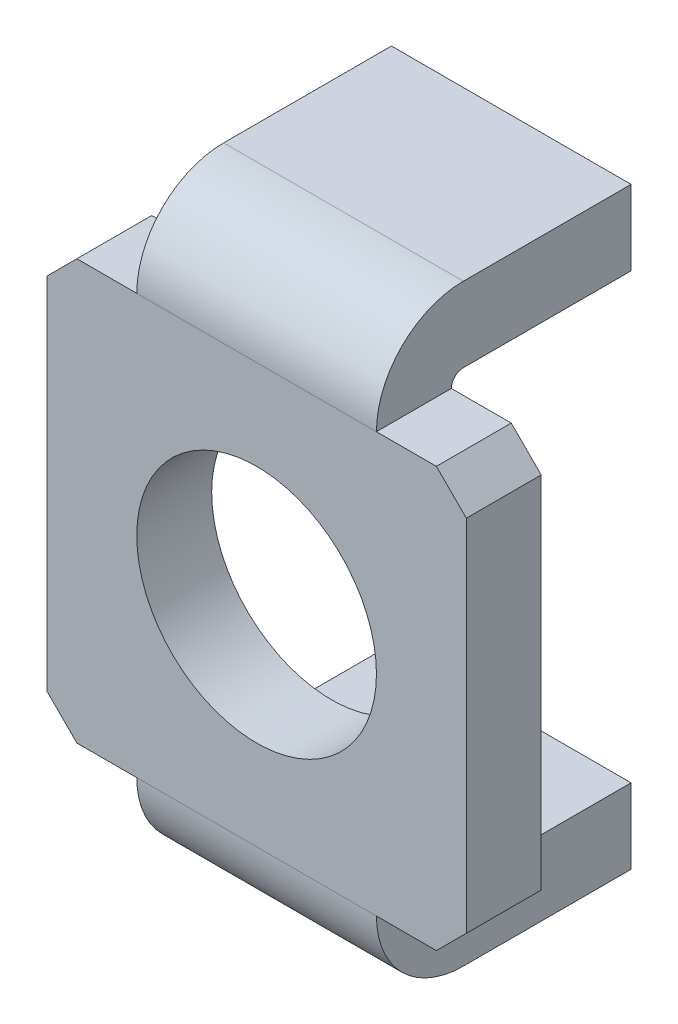
ISO-10303-21;
HEADER;
FILE_DESCRIPTION(('STEP AP214'),'2;1');
FILE_NAME('part.step','',(''),(''),'','','');
FILE_SCHEMA(('AUTOMOTIVE_DESIGN { 1 0 10303 214 1 1 1 1 }'));
ENDSEC;
DATA;
#1=APPLICATION_CONTEXT('core data for automotive mechanical design processes');
#2=APPLICATION_PROTOCOL_DEFINITION('international standard','automotive_design',2000,#1);
#3=PRODUCT_CONTEXT('',#1,'mechanical');
#4=PRODUCT('Part','Part','',(#3));
#5=PRODUCT_RELATED_PRODUCT_CATEGORY('part','',(#4));
#6=PRODUCT_DEFINITION_FORMATION('','',#4);
#7=PRODUCT_DEFINITION_CONTEXT('part definition',#1,'design');
#8=PRODUCT_DEFINITION('design','',#6,#7);
#9=PRODUCT_DEFINITION_SHAPE('','',#8);
#10=(LENGTH_UNIT() NAMED_UNIT(*) SI_UNIT(.MILLI.,.METRE.));
#11=(NAMED_UNIT(*) PLANE_ANGLE_UNIT() SI_UNIT($,.RADIAN.));
#12=(NAMED_UNIT(*) SI_UNIT($,.STERADIAN.) SOLID_ANGLE_UNIT());
#13=UNCERTAINTY_MEASURE_WITH_UNIT(LENGTH_MEASURE(1.E-05),#10,'distance_accuracy_value','');
#14=(GEOMETRIC_REPRESENTATION_CONTEXT(3) GLOBAL_UNCERTAINTY_ASSIGNED_CONTEXT((#13)) GLOBAL_UNIT_ASSIGNED_CONTEXT((#10,
#11,#12)) REPRESENTATION_CONTEXT('',''));
#15=CARTESIAN_POINT('',(0.,0.,0.));
#16=DIRECTION('',(0.,0.,1.));
#17=DIRECTION('',(1.,0.,0.));
#18=AXIS2_PLACEMENT_3D('',#15,#16,#17);
#19=CARTESIAN_POINT('',(0.,-4.95,0.));
#20=DIRECTION('',(0.,1.,0.));
#21=DIRECTION('',(0.,0.,1.));
#22=AXIS2_PLACEMENT_3D('',#19,#20,#21);
#23=PLANE('',#22);
#24=DIRECTION('',(0.,0.,1.));
#25=VECTOR('',#24,1.);
#26=CARTESIAN_POINT('',(-2.,-4.95000000000001,-4.25));
#27=LINE('',#26,#25);
#28=CARTESIAN_POINT('',(-2.,-4.95000000000001,-4.25));
#29=VERTEX_POINT('',#28);
#30=CARTESIAN_POINT('',(-2.,-4.95000000000001,-1.45));
#31=VERTEX_POINT('',#30);
#32=EDGE_CURVE('E197',#29,#31,#27,.T.);
#33=ORIENTED_EDGE('',*,*,#32,.F.);
#34=DIRECTION('',(1.,0.,0.));
#35=VECTOR('',#34,1.);
#36=CARTESIAN_POINT('',(-2.,-4.95000000000001,-4.25));
#37=LINE('',#36,#35);
#38=CARTESIAN_POINT('',(2.,-4.95,-4.25));
#39=VERTEX_POINT('',#38);
#40=EDGE_CURVE('E209',#39,#29,#37,.F.);
#41=ORIENTED_EDGE('',*,*,#40,.F.);
#42=DIRECTION('',(0.,0.,-1.));
#43=VECTOR('',#42,1.);
#44=CARTESIAN_POINT('',(2.,-4.95,-4.25));
#45=LINE('',#44,#43);
#46=CARTESIAN_POINT('',(2.,-4.95,-1.45));
#47=VERTEX_POINT('',#46);
#48=EDGE_CURVE('E201',#47,#39,#45,.T.);
#49=ORIENTED_EDGE('',*,*,#48,.F.);
#50=DIRECTION('',(-1.,0.,0.));
#51=VECTOR('',#50,1.);
#52=CARTESIAN_POINT('',(-2.,-4.95,-1.44999999999999));
#53=LINE('',#52,#51);
#54=EDGE_CURVE('E276',#31,#47,#53,.F.);
#55=ORIENTED_EDGE('',*,*,#54,.F.);
#56=EDGE_LOOP('',(#33,#41,#49,#55));
#57=FACE_BOUND('',#56,.T.);
#58=ADVANCED_FACE('F16',(#57),#23,.F.);
#59=CARTESIAN_POINT('',(0.,4.95,0.));
#60=DIRECTION('',(0.,-1.,0.));
#61=DIRECTION('',(0.,0.,-1.));
#62=AXIS2_PLACEMENT_3D('',#59,#60,#61);
#63=PLANE('',#62);
#64=DIRECTION('',(0.,0.,1.));
#65=VECTOR('',#64,1.);
#66=CARTESIAN_POINT('',(2.,4.95,-4.25));
#67=LINE('',#66,#65);
#68=CARTESIAN_POINT('',(2.,4.95,-1.45));
#69=VERTEX_POINT('',#68);
#70=CARTESIAN_POINT('',(2.,4.95000000000001,-4.25));
#71=VERTEX_POINT('',#70);
#72=EDGE_CURVE('E266',#69,#71,#67,.F.);
#73=ORIENTED_EDGE('',*,*,#72,.T.);
#74=DIRECTION('',(1.,0.,0.));
#75=VECTOR('',#74,1.);
#76=CARTESIAN_POINT('',(-2.,4.95000000000001,-4.25));
#77=LINE('',#76,#75);
#78=CARTESIAN_POINT('',(-2.,4.95000000000001,-4.25));
#79=VERTEX_POINT('',#78);
#80=EDGE_CURVE('E380',#71,#79,#77,.F.);
#81=ORIENTED_EDGE('',*,*,#80,.T.);
#82=DIRECTION('',(0.,0.,-1.));
#83=VECTOR('',#82,1.);
#84=CARTESIAN_POINT('',(-2.,4.95000000000001,-4.25));
#85=LINE('',#84,#83);
#86=CARTESIAN_POINT('',(-2.,4.95000000000001,-1.45));
#87=VERTEX_POINT('',#86);
#88=EDGE_CURVE('E387',#79,#87,#85,.F.);
#89=ORIENTED_EDGE('',*,*,#88,.T.);
#90=DIRECTION('',(1.,0.,0.));
#91=VECTOR('',#90,1.);
#92=CARTESIAN_POINT('',(2.,4.95,-1.45));
#93=LINE('',#92,#91);
#94=EDGE_CURVE('E267',#69,#87,#93,.F.);
#95=ORIENTED_EDGE('',*,*,#94,.F.);
#96=EDGE_LOOP('',(#73,#81,#89,#95));
#97=FACE_BOUND('',#96,.T.);
#98=ADVANCED_FACE('F406',(#97),#63,.F.);
#99=CARTESIAN_POINT('',(-2.,-4.95000000000001,-4.25));
#100=DIRECTION('',(-1.,0.,0.));
#101=DIRECTION('',(0.,0.,1.));
#102=AXIS2_PLACEMENT_3D('',#99,#100,#101);
#103=PLANE('',#102);
#104=DIRECTION('',(0.,0.,1.));
#105=VECTOR('',#104,1.);
#106=CARTESIAN_POINT('',(-2.,-3.7,0.));
#107=LINE('',#106,#105);
#108=CARTESIAN_POINT('',(-2.,-3.70000000000001,-4.25));
#109=VERTEX_POINT('',#108);
#110=CARTESIAN_POINT('',(-2.,-3.7,-1.45));
#111=VERTEX_POINT('',#110);
#112=EDGE_CURVE('E154',#109,#111,#107,.T.);
#113=ORIENTED_EDGE('',*,*,#112,.F.);
#114=DIRECTION('',(0.,1.,0.));
#115=VECTOR('',#114,1.);
#116=CARTESIAN_POINT('',(-2.,-4.95000000000001,-4.25));
#117=LINE('',#116,#115);
#118=EDGE_CURVE('E205',#29,#109,#117,.T.);
#119=ORIENTED_EDGE('',*,*,#118,.F.);
#120=ORIENTED_EDGE('',*,*,#32,.T.);
#121=CARTESIAN_POINT('',(-2.,-3.5,-1.45));
#122=DIRECTION('',(-1.,0.,0.));
#123=DIRECTION('',(0.,0.,1.));
#124=AXIS2_PLACEMENT_3D('',#121,#122,#123);
#125=CIRCLE('',#124,1.45);
#126=CARTESIAN_POINT('',(-2.,-3.5,0.));
#127=VERTEX_POINT('',#126);
#128=EDGE_CURVE('E208',#127,#31,#125,.F.);
#129=ORIENTED_EDGE('',*,*,#128,.F.);
#130=DIRECTION('',(0.,0.,-1.));
#131=VECTOR('',#130,1.);
#132=CARTESIAN_POINT('',(-2.,-3.5,-1.45));
#133=LINE('',#132,#131);
#134=CARTESIAN_POINT('',(-2.,-3.5,-1.25));
#135=VERTEX_POINT('',#134);
#136=EDGE_CURVE('E157',#135,#127,#133,.F.);
#137=ORIENTED_EDGE('',*,*,#136,.F.);
#138=CARTESIAN_POINT('',(-2.,-3.5,-1.45));
#139=DIRECTION('',(-1.,0.,0.));
#140=DIRECTION('',(0.,0.,1.));
#141=AXIS2_PLACEMENT_3D('',#138,#139,#140);
#142=CIRCLE('',#141,0.2);
#143=EDGE_CURVE('E19',#111,#135,#142,.T.);
#144=ORIENTED_EDGE('',*,*,#143,.F.);
#145=EDGE_LOOP('',(#113,#119,#120,#129,#137,#144));
#146=FACE_BOUND('',#145,.T.);
#147=ADVANCED_FACE('F152',(#146),#103,.T.);
#148=CARTESIAN_POINT('',(2.,-4.95000000000001,-4.25));
#149=DIRECTION('',(1.,0.,0.));
#150=DIRECTION('',(0.,0.,-1.));
#151=AXIS2_PLACEMENT_3D('',#148,#149,#150);
#152=PLANE('',#151);
#153=ORIENTED_EDGE('',*,*,#48,.T.);
#154=DIRECTION('',(0.,1.,0.));
#155=VECTOR('',#154,1.);
#156=CARTESIAN_POINT('',(2.,-4.95000000000001,-4.25));
#157=LINE('',#156,#155);
#158=CARTESIAN_POINT('',(2.,-3.70000000000001,-4.25));
#159=VERTEX_POINT('',#158);
#160=EDGE_CURVE('E310',#159,#39,#157,.F.);
#161=ORIENTED_EDGE('',*,*,#160,.F.);
#162=DIRECTION('',(0.,0.,1.));
#163=VECTOR('',#162,1.);
#164=CARTESIAN_POINT('',(2.,-3.7,0.));
#165=LINE('',#164,#163);
#166=CARTESIAN_POINT('',(2.,-3.7,-1.45));
#167=VERTEX_POINT('',#166);
#168=EDGE_CURVE('E173',#167,#159,#165,.F.);
#169=ORIENTED_EDGE('',*,*,#168,.F.);
#170=CARTESIAN_POINT('',(2.,-3.5,-1.45));
#171=DIRECTION('',(-1.,0.,0.));
#172=DIRECTION('',(0.,0.,1.));
#173=AXIS2_PLACEMENT_3D('',#170,#171,#172);
#174=CIRCLE('',#173,0.2);
#175=CARTESIAN_POINT('',(2.,-3.5,-1.25));
#176=VERTEX_POINT('',#175);
#177=EDGE_CURVE('E163',#167,#176,#174,.T.);
#178=ORIENTED_EDGE('',*,*,#177,.T.);
#179=DIRECTION('',(0.,0.,-1.));
#180=VECTOR('',#179,1.);
#181=CARTESIAN_POINT('',(2.,-3.5,-1.45));
#182=LINE('',#181,#180);
#183=CARTESIAN_POINT('',(2.,-3.5,0.));
#184=VERTEX_POINT('',#183);
#185=EDGE_CURVE('E287',#176,#184,#182,.F.);
#186=ORIENTED_EDGE('',*,*,#185,.T.);
#187=CARTESIAN_POINT('',(2.,-3.5,-1.45));
#188=DIRECTION('',(-1.,0.,0.));
#189=DIRECTION('',(0.,0.,1.));
#190=AXIS2_PLACEMENT_3D('',#187,#188,#189);
#191=CIRCLE('',#190,1.45);
#192=EDGE_CURVE('E272',#47,#184,#191,.T.);
#193=ORIENTED_EDGE('',*,*,#192,.F.);
#194=EDGE_LOOP('',(#153,#161,#169,#178,#186,#193));
#195=FACE_BOUND('',#194,.T.);
#196=ADVANCED_FACE('F326',(#195),#152,.T.);
#197=CARTESIAN_POINT('',(-2.,-4.95000000000001,-4.25));
#198=DIRECTION('',(0.,0.,-1.));
#199=DIRECTION('',(0.,1.,0.));
#200=AXIS2_PLACEMENT_3D('',#197,#198,#199);
#201=PLANE('',#200);
#202=ORIENTED_EDGE('',*,*,#40,.T.);
#203=ORIENTED_EDGE('',*,*,#118,.T.);
#204=DIRECTION('',(1.,0.,0.));
#205=VECTOR('',#204,1.);
#206=CARTESIAN_POINT('',(0.,-3.70000000000001,-4.25));
#207=LINE('',#206,#205);
#208=EDGE_CURVE('E171',#159,#109,#207,.F.);
#209=ORIENTED_EDGE('',*,*,#208,.F.);
#210=ORIENTED_EDGE('',*,*,#160,.T.);
#211=EDGE_LOOP('',(#202,#203,#209,#210));
#212=FACE_BOUND('',#211,.T.);
#213=ADVANCED_FACE('F324',(#212),#201,.T.);
#214=CARTESIAN_POINT('',(-2.,-3.5,-1.45));
#215=DIRECTION('',(-1.,0.,0.));
#216=DIRECTION('',(0.,0.,1.));
#217=AXIS2_PLACEMENT_3D('',#214,#215,#216);
#218=CYLINDRICAL_SURFACE('',#217,1.45);
#219=ORIENTED_EDGE('',*,*,#54,.T.);
#220=ORIENTED_EDGE('',*,*,#192,.T.);
#221=DIRECTION('',(-1.,0.,0.));
#222=VECTOR('',#221,1.);
#223=CARTESIAN_POINT('',(0.,-3.50000000000001,0.));
#224=LINE('',#223,#222);
#225=EDGE_CURVE('E302',#184,#127,#224,.T.);
#226=ORIENTED_EDGE('',*,*,#225,.T.);
#227=ORIENTED_EDGE('',*,*,#128,.T.);
#228=EDGE_LOOP('',(#219,#220,#226,#227));
#229=FACE_BOUND('',#228,.T.);
#230=ADVANCED_FACE('F332',(#229),#218,.T.);
#231=CARTESIAN_POINT('',(2.,3.5,-1.45));
#232=DIRECTION('',(1.,0.,0.));
#233=DIRECTION('',(0.,0.,-1.));
#234=AXIS2_PLACEMENT_3D('',#231,#232,#233);
#235=CYLINDRICAL_SURFACE('',#234,1.45);
#236=ORIENTED_EDGE('',*,*,#94,.T.);
#237=CARTESIAN_POINT('',(-2.,3.5,-1.45));
#238=DIRECTION('',(1.,0.,0.));
#239=DIRECTION('',(0.,0.,-1.));
#240=AXIS2_PLACEMENT_3D('',#237,#238,#239);
#241=CIRCLE('',#240,1.45);
#242=CARTESIAN_POINT('',(-2.,3.5,0.));
#243=VERTEX_POINT('',#242);
#244=EDGE_CURVE('E263',#87,#243,#241,.T.);
#245=ORIENTED_EDGE('',*,*,#244,.T.);
#246=DIRECTION('',(-1.,0.,0.));
#247=VECTOR('',#246,1.);
#248=CARTESIAN_POINT('',(0.,3.5,0.));
#249=LINE('',#248,#247);
#250=CARTESIAN_POINT('',(2.,3.5,0.));
#251=VERTEX_POINT('',#250);
#252=EDGE_CURVE('E395',#243,#251,#249,.F.);
#253=ORIENTED_EDGE('',*,*,#252,.T.);
#254=CARTESIAN_POINT('',(2.,3.5,-1.45));
#255=DIRECTION('',(1.,0.,0.));
#256=DIRECTION('',(0.,0.,-1.));
#257=AXIS2_PLACEMENT_3D('',#254,#255,#256);
#258=CIRCLE('',#257,1.45);
#259=EDGE_CURVE('E268',#251,#69,#258,.F.);
#260=ORIENTED_EDGE('',*,*,#259,.T.);
#261=EDGE_LOOP('',(#236,#245,#253,#260));
#262=FACE_BOUND('',#261,.T.);
#263=ADVANCED_FACE('F424',(#262),#235,.T.);
#264=CARTESIAN_POINT('',(2.,4.95000000000001,-4.25));
#265=DIRECTION('',(-1.,0.,0.));
#266=DIRECTION('',(0.,0.,1.));
#267=AXIS2_PLACEMENT_3D('',#264,#265,#266);
#268=PLANE('',#267);
#269=DIRECTION('',(0.,0.,-1.));
#270=VECTOR('',#269,1.);
#271=CARTESIAN_POINT('',(2.,3.7,0.));
#272=LINE('',#271,#270);
#273=CARTESIAN_POINT('',(2.,3.70000000000001,-4.25));
#274=VERTEX_POINT('',#273);
#275=CARTESIAN_POINT('',(2.,3.7,-1.45));
#276=VERTEX_POINT('',#275);
#277=EDGE_CURVE('E226',#274,#276,#272,.F.);
#278=ORIENTED_EDGE('',*,*,#277,.F.);
#279=DIRECTION('',(0.,-1.,0.));
#280=VECTOR('',#279,1.);
#281=CARTESIAN_POINT('',(2.,4.95000000000001,-4.25));
#282=LINE('',#281,#280);
#283=EDGE_CURVE('E383',#274,#71,#282,.F.);
#284=ORIENTED_EDGE('',*,*,#283,.T.);
#285=ORIENTED_EDGE('',*,*,#72,.F.);
#286=ORIENTED_EDGE('',*,*,#259,.F.);
#287=DIRECTION('',(0.,0.,1.));
#288=VECTOR('',#287,1.);
#289=CARTESIAN_POINT('',(2.,3.5,-1.45));
#290=LINE('',#289,#288);
#291=CARTESIAN_POINT('',(2.,3.5,-1.25));
#292=VERTEX_POINT('',#291);
#293=EDGE_CURVE('E285',#292,#251,#290,.T.);
#294=ORIENTED_EDGE('',*,*,#293,.F.);
#295=CARTESIAN_POINT('',(2.,3.5,-1.45));
#296=DIRECTION('',(1.,0.,0.));
#297=DIRECTION('',(0.,0.,-1.));
#298=AXIS2_PLACEMENT_3D('',#295,#296,#297);
#299=CIRCLE('',#298,0.2);
#300=EDGE_CURVE('E283',#276,#292,#299,.T.);
#301=ORIENTED_EDGE('',*,*,#300,.F.);
#302=EDGE_LOOP('',(#278,#284,#285,#286,#294,#301));
#303=FACE_BOUND('',#302,.T.);
#304=ADVANCED_FACE('F412',(#303),#268,.F.);
#305=CARTESIAN_POINT('',(-2.,4.95000000000001,-4.25));
#306=DIRECTION('',(1.,0.,0.));
#307=DIRECTION('',(0.,0.,-1.));
#308=AXIS2_PLACEMENT_3D('',#305,#306,#307);
#309=PLANE('',#308);
#310=ORIENTED_EDGE('',*,*,#88,.F.);
#311=DIRECTION('',(0.,-1.,0.));
#312=VECTOR('',#311,1.);
#313=CARTESIAN_POINT('',(-2.,4.95000000000001,-4.25));
#314=LINE('',#313,#312);
#315=CARTESIAN_POINT('',(-2.,3.70000000000001,-4.25));
#316=VERTEX_POINT('',#315);
#317=EDGE_CURVE('E174',#79,#316,#314,.T.);
#318=ORIENTED_EDGE('',*,*,#317,.T.);
#319=DIRECTION('',(0.,0.,-1.));
#320=VECTOR('',#319,1.);
#321=CARTESIAN_POINT('',(-2.,3.7,0.));
#322=LINE('',#321,#320);
#323=CARTESIAN_POINT('',(-2.,3.7,-1.45));
#324=VERTEX_POINT('',#323);
#325=EDGE_CURVE('E221',#324,#316,#322,.T.);
#326=ORIENTED_EDGE('',*,*,#325,.F.);
#327=CARTESIAN_POINT('',(-2.,3.5,-1.45));
#328=DIRECTION('',(1.,0.,0.));
#329=DIRECTION('',(0.,0.,-1.));
#330=AXIS2_PLACEMENT_3D('',#327,#328,#329);
#331=CIRCLE('',#330,0.2);
#332=CARTESIAN_POINT('',(-2.,3.5,-1.25));
#333=VERTEX_POINT('',#332);
#334=EDGE_CURVE('E279',#324,#333,#331,.T.);
#335=ORIENTED_EDGE('',*,*,#334,.T.);
#336=DIRECTION('',(0.,0.,1.));
#337=VECTOR('',#336,1.);
#338=CARTESIAN_POINT('',(-2.,3.5,-1.45));
#339=LINE('',#338,#337);
#340=EDGE_CURVE('E202',#333,#243,#339,.T.);
#341=ORIENTED_EDGE('',*,*,#340,.T.);
#342=ORIENTED_EDGE('',*,*,#244,.F.);
#343=EDGE_LOOP('',(#310,#318,#326,#335,#341,#342));
#344=FACE_BOUND('',#343,.T.);
#345=ADVANCED_FACE('F420',(#344),#309,.F.);
#346=CARTESIAN_POINT('',(-2.,4.95000000000001,-4.25));
#347=DIRECTION('',(0.,0.,1.));
#348=DIRECTION('',(0.,-1.,0.));
#349=AXIS2_PLACEMENT_3D('',#346,#347,#348);
#350=PLANE('',#349);
#351=ORIENTED_EDGE('',*,*,#317,.F.);
#352=ORIENTED_EDGE('',*,*,#80,.F.);
#353=ORIENTED_EDGE('',*,*,#283,.F.);
#354=DIRECTION('',(1.,0.,0.));
#355=VECTOR('',#354,1.);
#356=CARTESIAN_POINT('',(0.,3.70000000000001,-4.25));
#357=LINE('',#356,#355);
#358=EDGE_CURVE('E225',#316,#274,#357,.T.);
#359=ORIENTED_EDGE('',*,*,#358,.F.);
#360=EDGE_LOOP('',(#351,#352,#353,#359));
#361=FACE_BOUND('',#360,.T.);
#362=ADVANCED_FACE('F417',(#361),#350,.F.);
#363=CARTESIAN_POINT('',(0.,-3.7,0.));
#364=DIRECTION('',(0.,1.,0.));
#365=DIRECTION('',(0.,0.,1.));
#366=AXIS2_PLACEMENT_3D('',#363,#364,#365);
#367=PLANE('',#366);
#368=ORIENTED_EDGE('',*,*,#168,.T.);
#369=ORIENTED_EDGE('',*,*,#208,.T.);
#370=ORIENTED_EDGE('',*,*,#112,.T.);
#371=DIRECTION('',(-1.,0.,0.));
#372=VECTOR('',#371,1.);
#373=CARTESIAN_POINT('',(-2.,-3.7,-1.45));
#374=LINE('',#373,#372);
#375=EDGE_CURVE('E169',#111,#167,#374,.F.);
#376=ORIENTED_EDGE('',*,*,#375,.T.);
#377=EDGE_LOOP('',(#368,#369,#370,#376));
#378=FACE_BOUND('',#377,.T.);
#379=ADVANCED_FACE('F168',(#378),#367,.T.);
#380=CARTESIAN_POINT('',(0.,0.,0.));
#381=DIRECTION('',(0.,0.,-1.));
#382=DIRECTION('',(-1.,0.,0.));
#383=AXIS2_PLACEMENT_3D('',#380,#381,#382);
#384=PLANE('',#383);
#385=DIRECTION('',(-0.707106781186547,-0.707106781186548,0.));
#386=VECTOR('',#385,1.);
#387=CARTESIAN_POINT('',(3.,-3.5,0.));
#388=LINE('',#387,#386);
#389=CARTESIAN_POINT('',(3.,-3.5,0.));
#390=VERTEX_POINT('',#389);
#391=CARTESIAN_POINT('',(3.5,-2.99999999999999,0.));
#392=VERTEX_POINT('',#391);
#393=EDGE_CURVE('E362',#390,#392,#388,.F.);
#394=ORIENTED_EDGE('',*,*,#393,.T.);
#395=DIRECTION('',(0.,1.,0.));
#396=VECTOR('',#395,1.);
#397=CARTESIAN_POINT('',(3.5,3.5,0.));
#398=LINE('',#397,#396);
#399=CARTESIAN_POINT('',(3.5,3.,0.));
#400=VERTEX_POINT('',#399);
#401=EDGE_CURVE('E262',#400,#392,#398,.F.);
#402=ORIENTED_EDGE('',*,*,#401,.F.);
#403=DIRECTION('',(0.707106781186549,-0.707106781186546,0.));
#404=VECTOR('',#403,1.);
#405=CARTESIAN_POINT('',(3.,3.5,0.));
#406=LINE('',#405,#404);
#407=CARTESIAN_POINT('',(2.99999999999999,3.5,0.));
#408=VERTEX_POINT('',#407);
#409=EDGE_CURVE('E239',#408,#400,#406,.T.);
#410=ORIENTED_EDGE('',*,*,#409,.F.);
#411=DIRECTION('',(-1.,0.,0.));
#412=VECTOR('',#411,1.);
#413=CARTESIAN_POINT('',(0.,3.5,0.));
#414=LINE('',#413,#412);
#415=EDGE_CURVE('E298',#251,#408,#414,.F.);
#416=ORIENTED_EDGE('',*,*,#415,.F.);
#417=ORIENTED_EDGE('',*,*,#252,.F.);
#418=DIRECTION('',(-1.,0.,0.));
#419=VECTOR('',#418,1.);
#420=CARTESIAN_POINT('',(0.,3.5,0.));
#421=LINE('',#420,#419);
#422=CARTESIAN_POINT('',(-3.,3.5,0.));
#423=VERTEX_POINT('',#422);
#424=EDGE_CURVE('E375',#423,#243,#421,.F.);
#425=ORIENTED_EDGE('',*,*,#424,.F.);
#426=DIRECTION('',(0.707106781186547,0.707106781186548,0.));
#427=VECTOR('',#426,1.);
#428=CARTESIAN_POINT('',(-3.5,3.,0.));
#429=LINE('',#428,#427);
#430=CARTESIAN_POINT('',(-3.5,3.,0.));
#431=VERTEX_POINT('',#430);
#432=EDGE_CURVE('E305',#431,#423,#429,.T.);
#433=ORIENTED_EDGE('',*,*,#432,.F.);
#434=DIRECTION('',(0.,-1.,0.));
#435=VECTOR('',#434,1.);
#436=CARTESIAN_POINT('',(-3.5,3.5,0.));
#437=LINE('',#436,#435);
#438=CARTESIAN_POINT('',(-3.5,-3.,0.));
#439=VERTEX_POINT('',#438);
#440=EDGE_CURVE('E352',#439,#431,#437,.F.);
#441=ORIENTED_EDGE('',*,*,#440,.F.);
#442=DIRECTION('',(-0.707106781186549,0.707106781186546,0.));
#443=VECTOR('',#442,1.);
#444=CARTESIAN_POINT('',(-3.5,-3.,0.));
#445=LINE('',#444,#443);
#446=CARTESIAN_POINT('',(-3.,-3.5,0.));
#447=VERTEX_POINT('',#446);
#448=EDGE_CURVE('E188',#439,#447,#445,.F.);
#449=ORIENTED_EDGE('',*,*,#448,.T.);
#450=DIRECTION('',(1.,0.,0.));
#451=VECTOR('',#450,1.);
#452=CARTESIAN_POINT('',(3.5,-3.5,0.));
#453=LINE('',#452,#451);
#454=EDGE_CURVE('E180',#127,#447,#453,.F.);
#455=ORIENTED_EDGE('',*,*,#454,.F.);
#456=ORIENTED_EDGE('',*,*,#225,.F.);
#457=DIRECTION('',(1.,0.,0.));
#458=VECTOR('',#457,1.);
#459=CARTESIAN_POINT('',(3.5,-3.5,0.));
#460=LINE('',#459,#458);
#461=EDGE_CURVE('E181',#390,#184,#460,.F.);
#462=ORIENTED_EDGE('',*,*,#461,.F.);
#463=EDGE_LOOP('',(#394,#402,#410,#416,#417,#425,#433,#441,#449,#455,#456,#462));
#464=FACE_BOUND('',#463,.T.);
#465=CARTESIAN_POINT('',(0.,0.,0.));
#466=DIRECTION('',(0.,0.,1.));
#467=DIRECTION('',(1.,0.,0.));
#468=AXIS2_PLACEMENT_3D('',#465,#466,#467);
#469=CIRCLE('',#468,2.);
#470=CARTESIAN_POINT('',(2.,0.,0.));
#471=VERTEX_POINT('',#470);
#472=EDGE_CURVE('E258',#471,#471,#469,.F.);
#473=ORIENTED_EDGE('',*,*,#472,.T.);
#474=EDGE_LOOP('',(#473));
#475=FACE_BOUND('',#474,.T.);
#476=ADVANCED_FACE('F335',(#464,#475),#384,.F.);
#477=CARTESIAN_POINT('',(0.,3.7,0.));
#478=DIRECTION('',(0.,-1.,0.));
#479=DIRECTION('',(0.,0.,-1.));
#480=AXIS2_PLACEMENT_3D('',#477,#478,#479);
#481=PLANE('',#480);
#482=ORIENTED_EDGE('',*,*,#325,.T.);
#483=ORIENTED_EDGE('',*,*,#358,.T.);
#484=ORIENTED_EDGE('',*,*,#277,.T.);
#485=DIRECTION('',(1.,0.,0.));
#486=VECTOR('',#485,1.);
#487=CARTESIAN_POINT('',(2.,3.7,-1.45));
#488=LINE('',#487,#486);
#489=EDGE_CURVE('E227',#276,#324,#488,.F.);
#490=ORIENTED_EDGE('',*,*,#489,.T.);
#491=EDGE_LOOP('',(#482,#483,#484,#490));
#492=FACE_BOUND('',#491,.T.);
#493=ADVANCED_FACE('F438',(#492),#481,.T.);
#494=CARTESIAN_POINT('',(0.,0.,-1.25));
#495=DIRECTION('',(0.,0.,1.));
#496=DIRECTION('',(1.,0.,0.));
#497=AXIS2_PLACEMENT_3D('',#494,#495,#496);
#498=CYLINDRICAL_SURFACE('',#497,2.);
#499=ORIENTED_EDGE('',*,*,#472,.F.);
#500=EDGE_LOOP('',(#499));
#501=FACE_BOUND('',#500,.T.);
#502=CARTESIAN_POINT('',(0.,0.,-1.25));
#503=DIRECTION('',(0.,0.,1.));
#504=DIRECTION('',(1.,0.,0.));
#505=AXIS2_PLACEMENT_3D('',#502,#503,#504);
#506=CIRCLE('',#505,2.);
#507=CARTESIAN_POINT('',(2.,0.,-1.25));
#508=VERTEX_POINT('',#507);
#509=EDGE_CURVE('E253',#508,#508,#506,.T.);
#510=ORIENTED_EDGE('',*,*,#509,.F.);
#511=EDGE_LOOP('',(#510));
#512=FACE_BOUND('',#511,.T.);
#513=ADVANCED_FACE('F440',(#501,#512),#498,.F.);
#514=CARTESIAN_POINT('',(3.5,3.5,-1.25));
#515=DIRECTION('',(1.,0.,0.));
#516=DIRECTION('',(0.,1.,0.));
#517=AXIS2_PLACEMENT_3D('',#514,#515,#516);
#518=PLANE('',#517);
#519=DIRECTION('',(0.,1.,0.));
#520=VECTOR('',#519,1.);
#521=CARTESIAN_POINT('',(3.5,0.,-1.25));
#522=LINE('',#521,#520);
#523=CARTESIAN_POINT('',(3.5,3.,-1.25));
#524=VERTEX_POINT('',#523);
#525=CARTESIAN_POINT('',(3.5,-2.99999999999999,-1.25));
#526=VERTEX_POINT('',#525);
#527=EDGE_CURVE('E257',#524,#526,#522,.F.);
#528=ORIENTED_EDGE('',*,*,#527,.F.);
#529=DIRECTION('',(0.,0.,1.));
#530=VECTOR('',#529,1.);
#531=CARTESIAN_POINT('',(3.5,3.,-1.25));
#532=LINE('',#531,#530);
#533=EDGE_CURVE('E231',#524,#400,#532,.T.);
#534=ORIENTED_EDGE('',*,*,#533,.T.);
#535=ORIENTED_EDGE('',*,*,#401,.T.);
#536=DIRECTION('',(0.,0.,1.));
#537=VECTOR('',#536,1.);
#538=CARTESIAN_POINT('',(3.5,-2.99999999999999,-1.25));
#539=LINE('',#538,#537);
#540=EDGE_CURVE('E360',#392,#526,#539,.F.);
#541=ORIENTED_EDGE('',*,*,#540,.T.);
#542=EDGE_LOOP('',(#528,#534,#535,#541));
#543=FACE_BOUND('',#542,.T.);
#544=ADVANCED_FACE('F447',(#543),#518,.T.);
#545=CARTESIAN_POINT('',(3.,-3.5,-1.25));
#546=DIRECTION('',(-0.707106781186548,0.707106781186547,0.));
#547=DIRECTION('',(-0.707106781186547,-0.707106781186548,0.));
#548=AXIS2_PLACEMENT_3D('',#545,#546,#547);
#549=PLANE('',#548);
#550=ORIENTED_EDGE('',*,*,#540,.F.);
#551=ORIENTED_EDGE('',*,*,#393,.F.);
#552=DIRECTION('',(0.,0.,1.));
#553=VECTOR('',#552,1.);
#554=CARTESIAN_POINT('',(3.,-3.5,-1.25));
#555=LINE('',#554,#553);
#556=CARTESIAN_POINT('',(3.,-3.5,-1.25));
#557=VERTEX_POINT('',#556);
#558=EDGE_CURVE('E192',#557,#390,#555,.T.);
#559=ORIENTED_EDGE('',*,*,#558,.F.);
#560=DIRECTION('',(-0.707106781186547,-0.707106781186548,0.));
#561=VECTOR('',#560,1.);
#562=CARTESIAN_POINT('',(3.5,-2.99999999999999,-1.25));
#563=LINE('',#562,#561);
#564=EDGE_CURVE('E248',#526,#557,#563,.T.);
#565=ORIENTED_EDGE('',*,*,#564,.F.);
#566=EDGE_LOOP('',(#550,#551,#559,#565));
#567=FACE_BOUND('',#566,.T.);
#568=ADVANCED_FACE('F485',(#567),#549,.F.);
#569=CARTESIAN_POINT('',(3.5,-3.5,-1.25));
#570=DIRECTION('',(0.,-1.,0.));
#571=DIRECTION('',(1.,0.,0.));
#572=AXIS2_PLACEMENT_3D('',#569,#570,#571);
#573=PLANE('',#572);
#574=ORIENTED_EDGE('',*,*,#461,.T.);
#575=ORIENTED_EDGE('',*,*,#185,.F.);
#576=DIRECTION('',(-1.,0.,0.));
#577=VECTOR('',#576,1.);
#578=CARTESIAN_POINT('',(0.,-3.5,-1.25));
#579=LINE('',#578,#577);
#580=EDGE_CURVE('E244',#557,#176,#579,.T.);
#581=ORIENTED_EDGE('',*,*,#580,.F.);
#582=ORIENTED_EDGE('',*,*,#558,.T.);
#583=EDGE_LOOP('',(#574,#575,#581,#582));
#584=FACE_BOUND('',#583,.T.);
#585=ADVANCED_FACE('F482',(#584),#573,.T.);
#586=CARTESIAN_POINT('',(-2.,-3.5,-1.45));
#587=DIRECTION('',(-1.,0.,0.));
#588=DIRECTION('',(0.,0.,1.));
#589=AXIS2_PLACEMENT_3D('',#586,#587,#588);
#590=CYLINDRICAL_SURFACE('',#589,0.2);
#591=ORIENTED_EDGE('',*,*,#177,.F.);
#592=ORIENTED_EDGE('',*,*,#375,.F.);
#593=ORIENTED_EDGE('',*,*,#143,.T.);
#594=DIRECTION('',(-1.,0.,0.));
#595=VECTOR('',#594,1.);
#596=CARTESIAN_POINT('',(0.,-3.5,-1.25));
#597=LINE('',#596,#595);
#598=EDGE_CURVE('E240',#176,#135,#597,.T.);
#599=ORIENTED_EDGE('',*,*,#598,.F.);
#600=EDGE_LOOP('',(#591,#592,#593,#599));
#601=FACE_BOUND('',#600,.T.);
#602=ADVANCED_FACE('F176',(#601),#590,.F.);
#603=CARTESIAN_POINT('',(3.5,-3.5,-1.25));
#604=DIRECTION('',(0.,-1.,0.));
#605=DIRECTION('',(1.,0.,0.));
#606=AXIS2_PLACEMENT_3D('',#603,#604,#605);
#607=PLANE('',#606);
#608=DIRECTION('',(-1.,0.,0.));
#609=VECTOR('',#608,1.);
#610=CARTESIAN_POINT('',(0.,-3.5,-1.25));
#611=LINE('',#610,#609);
#612=CARTESIAN_POINT('',(-3.,-3.5,-1.25));
#613=VERTEX_POINT('',#612);
#614=EDGE_CURVE('E243',#135,#613,#611,.T.);
#615=ORIENTED_EDGE('',*,*,#614,.F.);
#616=ORIENTED_EDGE('',*,*,#136,.T.);
#617=ORIENTED_EDGE('',*,*,#454,.T.);
#618=DIRECTION('',(0.,0.,1.));
#619=VECTOR('',#618,1.);
#620=CARTESIAN_POINT('',(-3.,-3.5,-1.25));
#621=LINE('',#620,#619);
#622=EDGE_CURVE('E342',#447,#613,#621,.F.);
#623=ORIENTED_EDGE('',*,*,#622,.T.);
#624=EDGE_LOOP('',(#615,#616,#617,#623));
#625=FACE_BOUND('',#624,.T.);
#626=ADVANCED_FACE('F341',(#625),#607,.T.);
#627=CARTESIAN_POINT('',(-3.5,-3.,-1.25));
#628=DIRECTION('',(0.707106781186546,0.707106781186549,0.));
#629=DIRECTION('',(-0.707106781186549,0.707106781186546,0.));
#630=AXIS2_PLACEMENT_3D('',#627,#628,#629);
#631=PLANE('',#630);
#632=ORIENTED_EDGE('',*,*,#622,.F.);
#633=ORIENTED_EDGE('',*,*,#448,.F.);
#634=DIRECTION('',(0.,0.,1.));
#635=VECTOR('',#634,1.);
#636=CARTESIAN_POINT('',(-3.5,-3.,-1.25));
#637=LINE('',#636,#635);
#638=CARTESIAN_POINT('',(-3.5,-3.,-1.25));
#639=VERTEX_POINT('',#638);
#640=EDGE_CURVE('E348',#639,#439,#637,.T.);
#641=ORIENTED_EDGE('',*,*,#640,.F.);
#642=DIRECTION('',(-0.707106781186549,0.707106781186546,0.));
#643=VECTOR('',#642,1.);
#644=CARTESIAN_POINT('',(-3.,-3.5,-1.25));
#645=LINE('',#644,#643);
#646=EDGE_CURVE('E252',#613,#639,#645,.T.);
#647=ORIENTED_EDGE('',*,*,#646,.F.);
#648=EDGE_LOOP('',(#632,#633,#641,#647));
#649=FACE_BOUND('',#648,.T.);
#650=ADVANCED_FACE('F345',(#649),#631,.F.);
#651=CARTESIAN_POINT('',(-3.5,3.5,-1.25));
#652=DIRECTION('',(-1.,0.,0.));
#653=DIRECTION('',(0.,-1.,0.));
#654=AXIS2_PLACEMENT_3D('',#651,#652,#653);
#655=PLANE('',#654);
#656=ORIENTED_EDGE('',*,*,#440,.T.);
#657=DIRECTION('',(0.,0.,1.));
#658=VECTOR('',#657,1.);
#659=CARTESIAN_POINT('',(-3.5,3.,-1.25));
#660=LINE('',#659,#658);
#661=CARTESIAN_POINT('',(-3.5,3.,-1.25));
#662=VERTEX_POINT('',#661);
#663=EDGE_CURVE('E511',#431,#662,#660,.F.);
#664=ORIENTED_EDGE('',*,*,#663,.T.);
#665=DIRECTION('',(0.,1.,0.));
#666=VECTOR('',#665,1.);
#667=CARTESIAN_POINT('',(-3.5,0.,-1.25));
#668=LINE('',#667,#666);
#669=EDGE_CURVE('E518',#639,#662,#668,.T.);
#670=ORIENTED_EDGE('',*,*,#669,.F.);
#671=ORIENTED_EDGE('',*,*,#640,.T.);
#672=EDGE_LOOP('',(#656,#664,#670,#671));
#673=FACE_BOUND('',#672,.T.);
#674=ADVANCED_FACE('F471',(#673),#655,.T.);
#675=CARTESIAN_POINT('',(-3.,3.5,-1.25));
#676=DIRECTION('',(0.707106781186549,-0.707106781186546,0.));
#677=DIRECTION('',(0.707106781186546,0.707106781186549,0.));
#678=AXIS2_PLACEMENT_3D('',#675,#676,#677);
#679=PLANE('',#678);
#680=ORIENTED_EDGE('',*,*,#663,.F.);
#681=ORIENTED_EDGE('',*,*,#432,.T.);
#682=DIRECTION('',(0.,0.,1.));
#683=VECTOR('',#682,1.);
#684=CARTESIAN_POINT('',(-3.,3.5,-1.25));
#685=LINE('',#684,#683);
#686=CARTESIAN_POINT('',(-3.,3.5,-1.25));
#687=VERTEX_POINT('',#686);
#688=EDGE_CURVE('E232',#687,#423,#685,.T.);
#689=ORIENTED_EDGE('',*,*,#688,.F.);
#690=DIRECTION('',(0.707106781186547,0.707106781186548,0.));
#691=VECTOR('',#690,1.);
#692=CARTESIAN_POINT('',(-3.5,3.,-1.25));
#693=LINE('',#692,#691);
#694=EDGE_CURVE('E220',#662,#687,#693,.T.);
#695=ORIENTED_EDGE('',*,*,#694,.F.);
#696=EDGE_LOOP('',(#680,#681,#689,#695));
#697=FACE_BOUND('',#696,.T.);
#698=ADVANCED_FACE('F467',(#697),#679,.F.);
#699=CARTESIAN_POINT('',(3.5,3.5,-1.25));
#700=DIRECTION('',(0.,1.,0.));
#701=DIRECTION('',(0.,0.,1.));
#702=AXIS2_PLACEMENT_3D('',#699,#700,#701);
#703=PLANE('',#702);
#704=ORIENTED_EDGE('',*,*,#424,.T.);
#705=ORIENTED_EDGE('',*,*,#340,.F.);
#706=DIRECTION('',(-1.,0.,0.));
#707=VECTOR('',#706,1.);
#708=CARTESIAN_POINT('',(0.,3.5,-1.25));
#709=LINE('',#708,#707);
#710=EDGE_CURVE('E216',#687,#333,#709,.F.);
#711=ORIENTED_EDGE('',*,*,#710,.F.);
#712=ORIENTED_EDGE('',*,*,#688,.T.);
#713=EDGE_LOOP('',(#704,#705,#711,#712));
#714=FACE_BOUND('',#713,.T.);
#715=ADVANCED_FACE('F464',(#714),#703,.T.);
#716=CARTESIAN_POINT('',(2.,3.5,-1.45));
#717=DIRECTION('',(1.,0.,0.));
#718=DIRECTION('',(0.,0.,-1.));
#719=AXIS2_PLACEMENT_3D('',#716,#717,#718);
#720=CYLINDRICAL_SURFACE('',#719,0.2);
#721=ORIENTED_EDGE('',*,*,#334,.F.);
#722=ORIENTED_EDGE('',*,*,#489,.F.);
#723=ORIENTED_EDGE('',*,*,#300,.T.);
#724=DIRECTION('',(-1.,0.,0.));
#725=VECTOR('',#724,1.);
#726=CARTESIAN_POINT('',(0.,3.5,-1.25));
#727=LINE('',#726,#725);
#728=EDGE_CURVE('E212',#333,#292,#727,.F.);
#729=ORIENTED_EDGE('',*,*,#728,.F.);
#730=EDGE_LOOP('',(#721,#722,#723,#729));
#731=FACE_BOUND('',#730,.T.);
#732=ADVANCED_FACE('F436',(#731),#720,.F.);
#733=CARTESIAN_POINT('',(3.5,3.5,-1.25));
#734=DIRECTION('',(0.,1.,0.));
#735=DIRECTION('',(0.,0.,1.));
#736=AXIS2_PLACEMENT_3D('',#733,#734,#735);
#737=PLANE('',#736);
#738=DIRECTION('',(-1.,0.,0.));
#739=VECTOR('',#738,1.);
#740=CARTESIAN_POINT('',(0.,3.5,-1.25));
#741=LINE('',#740,#739);
#742=CARTESIAN_POINT('',(3.,3.5,-1.25));
#743=VERTEX_POINT('',#742);
#744=EDGE_CURVE('E26',#292,#743,#741,.F.);
#745=ORIENTED_EDGE('',*,*,#744,.F.);
#746=ORIENTED_EDGE('',*,*,#293,.T.);
#747=ORIENTED_EDGE('',*,*,#415,.T.);
#748=DIRECTION('',(0.,0.,1.));
#749=VECTOR('',#748,1.);
#750=CARTESIAN_POINT('',(3.,3.5,-1.25));
#751=LINE('',#750,#749);
#752=EDGE_CURVE('E35',#408,#743,#751,.F.);
#753=ORIENTED_EDGE('',*,*,#752,.T.);
#754=EDGE_LOOP('',(#745,#746,#747,#753));
#755=FACE_BOUND('',#754,.T.);
#756=ADVANCED_FACE('F427',(#755),#737,.T.);
#757=CARTESIAN_POINT('',(3.5,3.,-1.25));
#758=DIRECTION('',(-0.707106781186546,-0.707106781186549,0.));
#759=DIRECTION('',(0.707106781186549,-0.707106781186546,0.));
#760=AXIS2_PLACEMENT_3D('',#757,#758,#759);
#761=PLANE('',#760);
#762=ORIENTED_EDGE('',*,*,#752,.F.);
#763=ORIENTED_EDGE('',*,*,#409,.T.);
#764=ORIENTED_EDGE('',*,*,#533,.F.);
#765=DIRECTION('',(0.707106781186549,-0.707106781186546,0.));
#766=VECTOR('',#765,1.);
#767=CARTESIAN_POINT('',(2.99999999999999,3.5,-1.25));
#768=LINE('',#767,#766);
#769=EDGE_CURVE('E11',#743,#524,#768,.T.);
#770=ORIENTED_EDGE('',*,*,#769,.F.);
#771=EDGE_LOOP('',(#762,#763,#764,#770));
#772=FACE_BOUND('',#771,.T.);
#773=ADVANCED_FACE('F452',(#772),#761,.F.);
#774=CARTESIAN_POINT('',(0.,0.,-1.25));
#775=DIRECTION('',(0.,0.,-1.));
#776=DIRECTION('',(-1.,0.,0.));
#777=AXIS2_PLACEMENT_3D('',#774,#775,#776);
#778=PLANE('',#777);
#779=ORIENTED_EDGE('',*,*,#744,.T.);
#780=ORIENTED_EDGE('',*,*,#769,.T.);
#781=ORIENTED_EDGE('',*,*,#527,.T.);
#782=ORIENTED_EDGE('',*,*,#564,.T.);
#783=ORIENTED_EDGE('',*,*,#580,.T.);
#784=ORIENTED_EDGE('',*,*,#598,.T.);
#785=ORIENTED_EDGE('',*,*,#614,.T.);
#786=ORIENTED_EDGE('',*,*,#646,.T.);
#787=ORIENTED_EDGE('',*,*,#669,.T.);
#788=ORIENTED_EDGE('',*,*,#694,.T.);
#789=ORIENTED_EDGE('',*,*,#710,.T.);
#790=ORIENTED_EDGE('',*,*,#728,.T.);
#791=EDGE_LOOP('',(#779,#780,#781,#782,#783,#784,#785,#786,#787,#788,#789,#790));
#792=FACE_BOUND('',#791,.T.);
#793=ORIENTED_EDGE('',*,*,#509,.T.);
#794=EDGE_LOOP('',(#793));
#795=FACE_BOUND('',#794,.T.);
#796=ADVANCED_FACE('F429',(#792,#795),#778,.T.);
#797=CLOSED_SHELL('',(#58,#98,#147,#196,#213,#230,#263,#304,#345,#362,#379,#476,#493,#513,#544,
#568,#585,#602,#626,#650,#674,#698,#715,#732,#756,#773,#796));
#798=MANIFOLD_SOLID_BREP('B1',#797);
#799=ADVANCED_BREP_SHAPE_REPRESENTATION('',(#18,#798),#14);
#800=SHAPE_DEFINITION_REPRESENTATION(#9,#799);
ENDSEC;
END-ISO-10303-21;
